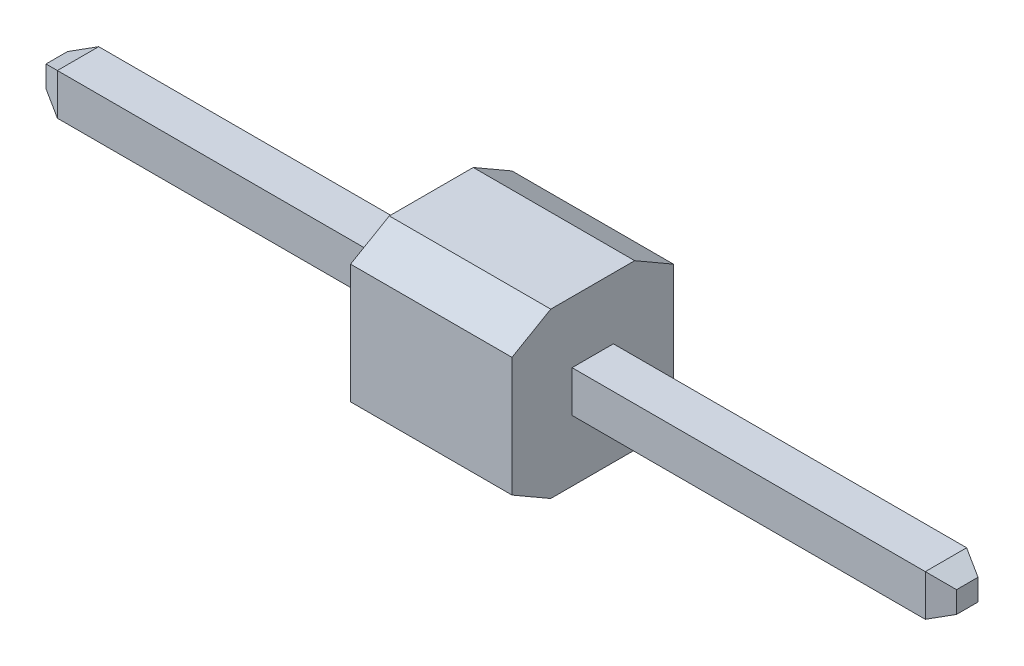
ISO-10303-21;
HEADER;
FILE_DESCRIPTION(('STEP AP214'),'2;1');
FILE_NAME('part.step','',(''),(''),'','','');
FILE_SCHEMA(('AUTOMOTIVE_DESIGN { 1 0 10303 214 1 1 1 1 }'));
ENDSEC;
DATA;
#1=APPLICATION_CONTEXT('core data for automotive mechanical design processes');
#2=APPLICATION_PROTOCOL_DEFINITION('international standard','automotive_design',2000,#1);
#3=PRODUCT_CONTEXT('',#1,'mechanical');
#4=PRODUCT('Part','Part','',(#3));
#5=PRODUCT_RELATED_PRODUCT_CATEGORY('part','',(#4));
#6=PRODUCT_DEFINITION_FORMATION('','',#4);
#7=PRODUCT_DEFINITION_CONTEXT('part definition',#1,'design');
#8=PRODUCT_DEFINITION('design','',#6,#7);
#9=PRODUCT_DEFINITION_SHAPE('','',#8);
#10=(LENGTH_UNIT() NAMED_UNIT(*) SI_UNIT(.MILLI.,.METRE.));
#11=(NAMED_UNIT(*) PLANE_ANGLE_UNIT() SI_UNIT($,.RADIAN.));
#12=(NAMED_UNIT(*) SI_UNIT($,.STERADIAN.) SOLID_ANGLE_UNIT());
#13=UNCERTAINTY_MEASURE_WITH_UNIT(LENGTH_MEASURE(1.E-05),#10,'distance_accuracy_value','');
#14=(GEOMETRIC_REPRESENTATION_CONTEXT(3) GLOBAL_UNCERTAINTY_ASSIGNED_CONTEXT((#13)) GLOBAL_UNIT_ASSIGNED_CONTEXT((#10,
#11,#12)) REPRESENTATION_CONTEXT('',''));
#15=CARTESIAN_POINT('',(0.,0.,0.));
#16=DIRECTION('',(0.,0.,1.));
#17=DIRECTION('',(1.,0.,0.));
#18=AXIS2_PLACEMENT_3D('',#15,#16,#17);
#19=CARTESIAN_POINT('',(5.42105037206763,-5.39712826291391,0.629998634255617));
#20=DIRECTION('',(1.,4.37113882867379E-08,-4.37113882867379E-08));
#21=DIRECTION('',(-4.37113882867379E-08,1.,0.));
#22=AXIS2_PLACEMENT_3D('',#19,#20,#21);
#23=PLANE('',#22);
#24=DIRECTION('',(1.59994777304464E-08,0.500000000000191,0.866025403784328));
#25=VECTOR('',#24,1.);
#26=CARTESIAN_POINT('',(5.42105024908172,-4.15353842442391,-0.940001365744382));
#27=LINE('',#26,#25);
#28=CARTESIAN_POINT('',(5.42105024908172,-4.15353842442391,-0.940001365744382));
#29=VERTEX_POINT('',#28);
#30=CARTESIAN_POINT('',(5.42105026016648,-3.80712826291392,-0.340001365744383));
#31=VERTEX_POINT('',#30);
#32=EDGE_CURVE('E11',#29,#31,#27,.T.);
#33=ORIENTED_EDGE('',*,*,#32,.T.);
#34=DIRECTION('',(4.37113886966664E-08,0.,0.999999999999999));
#35=VECTOR('',#34,1.);
#36=CARTESIAN_POINT('',(5.42105026016648,-3.80712826291392,-0.340001365744383));
#37=LINE('',#36,#35);
#38=CARTESIAN_POINT('',(5.42105031699128,-3.80712826291391,0.959998634255618));
#39=VERTEX_POINT('',#38);
#40=EDGE_CURVE('E304',#31,#39,#37,.T.);
#41=ORIENTED_EDGE('',*,*,#40,.T.);
#42=DIRECTION('',(5.97108668825762E-08,-0.500000000000186,0.866025403784329));
#43=VECTOR('',#42,1.);
#44=CARTESIAN_POINT('',(5.42105031699128,-3.80712826291391,0.959998634255618));
#45=LINE('',#44,#43);
#46=CARTESIAN_POINT('',(5.42105035836019,-4.15353842442391,1.55999863425562));
#47=VERTEX_POINT('',#46);
#48=EDGE_CURVE('E296',#39,#47,#45,.T.);
#49=ORIENTED_EDGE('',*,*,#48,.T.);
#50=DIRECTION('',(4.37113884815545E-08,-0.999999999999999,0.));
#51=VECTOR('',#50,1.);
#52=CARTESIAN_POINT('',(5.42105035836019,-4.15353842442391,1.55999863425562));
#53=LINE('',#52,#51);
#54=CARTESIAN_POINT('',(5.42105043910298,-6.00071810139391,1.55999863425562));
#55=VERTEX_POINT('',#54);
#56=EDGE_CURVE('E281',#47,#55,#53,.T.);
#57=ORIENTED_EDGE('',*,*,#56,.T.);
#58=DIRECTION('',(1.5999479012306E-08,0.500000000000191,0.866025403784328));
#59=VECTOR('',#58,1.);
#60=CARTESIAN_POINT('',(5.42105042801821,-6.34712826291391,0.959998634255618));
#61=LINE('',#60,#59);
#62=CARTESIAN_POINT('',(5.42105042801821,-6.34712826291391,0.959998634255618));
#63=VERTEX_POINT('',#62);
#64=EDGE_CURVE('E265',#63,#55,#61,.T.);
#65=ORIENTED_EDGE('',*,*,#64,.F.);
#66=DIRECTION('',(4.37113886966664E-08,0.,0.999999999999999));
#67=VECTOR('',#66,1.);
#68=CARTESIAN_POINT('',(5.42105037119341,-6.34712826291392,-0.340001365744383));
#69=LINE('',#68,#67);
#70=CARTESIAN_POINT('',(5.42105037119341,-6.34712826291392,-0.340001365744383));
#71=VERTEX_POINT('',#70);
#72=EDGE_CURVE('E248',#71,#63,#69,.T.);
#73=ORIENTED_EDGE('',*,*,#72,.F.);
#74=DIRECTION('',(5.97108656001698E-08,-0.50000000000019,0.866025403784327));
#75=VECTOR('',#74,1.);
#76=CARTESIAN_POINT('',(5.4210503298245,-6.00071810139391,-0.940001365744382));
#77=LINE('',#76,#75);
#78=CARTESIAN_POINT('',(5.4210503298245,-6.00071810139391,-0.940001365744382));
#79=VERTEX_POINT('',#78);
#80=EDGE_CURVE('E242',#79,#71,#77,.T.);
#81=ORIENTED_EDGE('',*,*,#80,.F.);
#82=DIRECTION('',(4.37113884815545E-08,-0.999999999999999,0.));
#83=VECTOR('',#82,1.);
#84=CARTESIAN_POINT('',(5.42105024908172,-4.15353842442391,-0.940001365744382));
#85=LINE('',#84,#83);
#86=EDGE_CURVE('E236',#29,#79,#85,.T.);
#87=ORIENTED_EDGE('',*,*,#86,.F.);
#88=EDGE_LOOP('',(#33,#41,#49,#57,#65,#73,#81,#87));
#89=FACE_BOUND('',#88,.T.);
#90=DIRECTION('',(-4.37113872875372E-08,0.,-0.999999999999999));
#91=VECTOR('',#90,1.);
#92=CARTESIAN_POINT('',(5.42105034409235,-4.75712826291391,0.629998634255617));
#93=LINE('',#92,#91);
#94=CARTESIAN_POINT('',(5.42105034409235,-4.75712826291391,0.629998634255617));
#95=VERTEX_POINT('',#94);
#96=CARTESIAN_POINT('',(5.42105031611706,-4.75712826291391,-0.0100013657443826));
#97=VERTEX_POINT('',#96);
#98=EDGE_CURVE('E302',#95,#97,#93,.T.);
#99=ORIENTED_EDGE('',*,*,#98,.T.);
#100=DIRECTION('',(-4.37113872875371E-08,0.999999999999999,0.));
#101=VECTOR('',#100,1.);
#102=CARTESIAN_POINT('',(5.42105034409235,-5.39712826291391,-0.0100013657443826));
#103=LINE('',#102,#101);
#104=CARTESIAN_POINT('',(5.42105034409235,-5.39712826291391,-0.0100013657443826));
#105=VERTEX_POINT('',#104);
#106=EDGE_CURVE('E293',#105,#97,#103,.T.);
#107=ORIENTED_EDGE('',*,*,#106,.F.);
#108=DIRECTION('',(-4.37113900630947E-08,0.,-0.999999999999999));
#109=VECTOR('',#108,1.);
#110=CARTESIAN_POINT('',(5.42105037206763,-5.39712826291391,0.629998634255617));
#111=LINE('',#110,#109);
#112=CARTESIAN_POINT('',(5.42105037206763,-5.39712826291391,0.629998634255617));
#113=VERTEX_POINT('',#112);
#114=EDGE_CURVE('E278',#113,#105,#111,.T.);
#115=ORIENTED_EDGE('',*,*,#114,.F.);
#116=DIRECTION('',(-4.37113900630947E-08,0.999999999999999,0.));
#117=VECTOR('',#116,1.);
#118=CARTESIAN_POINT('',(5.42105037206763,-5.39712826291391,0.629998634255617));
#119=LINE('',#118,#117);
#120=EDGE_CURVE('E263',#113,#95,#119,.T.);
#121=ORIENTED_EDGE('',*,*,#120,.T.);
#122=EDGE_LOOP('',(#99,#107,#115,#121));
#123=FACE_BOUND('',#122,.T.);
#124=ADVANCED_FACE('F17',(#89,#123),#23,.T.);
#125=CARTESIAN_POINT('',(2.92105037206763,-5.39712837219238,0.629998743534088));
#126=DIRECTION('',(1.,4.37113882867379E-08,-4.37113882867379E-08));
#127=DIRECTION('',(-4.37113882867379E-08,1.,0.));
#128=AXIS2_PLACEMENT_3D('',#125,#126,#127);
#129=PLANE('',#128);
#130=DIRECTION('',(1.59994783714339E-08,0.500000000000191,0.866025403784328));
#131=VECTOR('',#130,1.);
#132=CARTESIAN_POINT('',(2.92105024908172,-4.15353853370238,-0.940001256465912));
#133=LINE('',#132,#131);
#134=CARTESIAN_POINT('',(2.92105024908172,-4.15353853370238,-0.940001256465912));
#135=VERTEX_POINT('',#134);
#136=CARTESIAN_POINT('',(2.92105026016648,-3.80712837219239,-0.340001256465912));
#137=VERTEX_POINT('',#136);
#138=EDGE_CURVE('E24',#135,#137,#133,.T.);
#139=ORIENTED_EDGE('',*,*,#138,.F.);
#140=DIRECTION('',(4.37113882411397E-08,-0.999999999999999,0.));
#141=VECTOR('',#140,1.);
#142=CARTESIAN_POINT('',(2.92105024908172,-4.15353853370238,-0.940001256465912));
#143=LINE('',#142,#141);
#144=CARTESIAN_POINT('',(2.9210503298245,-6.00071821067239,-0.940001256465912));
#145=VERTEX_POINT('',#144);
#146=EDGE_CURVE('E300',#135,#145,#143,.T.);
#147=ORIENTED_EDGE('',*,*,#146,.T.);
#148=DIRECTION('',(5.97108668821449E-08,-0.50000000000019,0.866025403784327));
#149=VECTOR('',#148,1.);
#150=CARTESIAN_POINT('',(2.9210503298245,-6.00071821067239,-0.940001256465912));
#151=LINE('',#150,#149);
#152=CARTESIAN_POINT('',(2.92105037119341,-6.34712837219239,-0.340001256465912));
#153=VERTEX_POINT('',#152);
#154=EDGE_CURVE('E286',#145,#153,#151,.T.);
#155=ORIENTED_EDGE('',*,*,#154,.T.);
#156=DIRECTION('',(4.37113883550593E-08,0.,0.999999999999999));
#157=VECTOR('',#156,1.);
#158=CARTESIAN_POINT('',(2.92105037119341,-6.34712837219239,-0.340001256465912));
#159=LINE('',#158,#157);
#160=CARTESIAN_POINT('',(2.92105042801821,-6.34712837219238,0.959998743534088));
#161=VERTEX_POINT('',#160);
#162=EDGE_CURVE('E271',#153,#161,#159,.T.);
#163=ORIENTED_EDGE('',*,*,#162,.T.);
#164=DIRECTION('',(1.59994783713184E-08,0.500000000000191,0.866025403784328));
#165=VECTOR('',#164,1.);
#166=CARTESIAN_POINT('',(2.92105042801821,-6.34712837219238,0.959998743534088));
#167=LINE('',#166,#165);
#168=CARTESIAN_POINT('',(2.92105043910298,-6.00071821067238,1.55999874353409));
#169=VERTEX_POINT('',#168);
#170=EDGE_CURVE('E253',#161,#169,#167,.T.);
#171=ORIENTED_EDGE('',*,*,#170,.T.);
#172=DIRECTION('',(4.37113882411397E-08,-0.999999999999999,0.));
#173=VECTOR('',#172,1.);
#174=CARTESIAN_POINT('',(2.92105035836019,-4.15353853370238,1.55999874353409));
#175=LINE('',#174,#173);
#176=CARTESIAN_POINT('',(2.92105035836019,-4.15353853370238,1.55999874353409));
#177=VERTEX_POINT('',#176);
#178=EDGE_CURVE('E261',#177,#169,#175,.T.);
#179=ORIENTED_EDGE('',*,*,#178,.F.);
#180=DIRECTION('',(5.97108668825762E-08,-0.500000000000186,0.866025403784329));
#181=VECTOR('',#180,1.);
#182=CARTESIAN_POINT('',(2.92105031699128,-3.80712837219238,0.959998743534088));
#183=LINE('',#182,#181);
#184=CARTESIAN_POINT('',(2.92105031699128,-3.80712837219238,0.959998743534088));
#185=VERTEX_POINT('',#184);
#186=EDGE_CURVE('E276',#185,#177,#183,.T.);
#187=ORIENTED_EDGE('',*,*,#186,.F.);
#188=DIRECTION('',(4.37113883550593E-08,0.,0.999999999999999));
#189=VECTOR('',#188,1.);
#190=CARTESIAN_POINT('',(2.92105026016648,-3.80712837219239,-0.340001256465912));
#191=LINE('',#190,#189);
#192=EDGE_CURVE('E291',#137,#185,#191,.T.);
#193=ORIENTED_EDGE('',*,*,#192,.F.);
#194=EDGE_LOOP('',(#139,#147,#155,#163,#171,#179,#187,#193));
#195=FACE_BOUND('',#194,.T.);
#196=DIRECTION('',(-4.37113879814265E-08,0.999999999999999,0.));
#197=VECTOR('',#196,1.);
#198=CARTESIAN_POINT('',(2.92105034409235,-5.39712837219238,-0.0100012564659119));
#199=LINE('',#198,#197);
#200=CARTESIAN_POINT('',(2.92105034409235,-5.39712837219238,-0.0100012564659119));
#201=VERTEX_POINT('',#200);
#202=CARTESIAN_POINT('',(2.92105031611706,-4.75712837219238,-0.0100012564659119));
#203=VERTEX_POINT('',#202);
#204=EDGE_CURVE('E298',#201,#203,#199,.T.);
#205=ORIENTED_EDGE('',*,*,#204,.T.);
#206=DIRECTION('',(-4.37113879814266E-08,0.,-0.999999999999999));
#207=VECTOR('',#206,1.);
#208=CARTESIAN_POINT('',(2.92105034409235,-4.75712837219238,0.629998743534088));
#209=LINE('',#208,#207);
#210=CARTESIAN_POINT('',(2.92105034409235,-4.75712837219238,0.629998743534088));
#211=VERTEX_POINT('',#210);
#212=EDGE_CURVE('E283',#211,#203,#209,.T.);
#213=ORIENTED_EDGE('',*,*,#212,.F.);
#214=DIRECTION('',(-4.37113886753159E-08,0.999999999999999,0.));
#215=VECTOR('',#214,1.);
#216=CARTESIAN_POINT('',(2.92105037206763,-5.39712837219238,0.629998743534088));
#217=LINE('',#216,#215);
#218=CARTESIAN_POINT('',(2.92105037206763,-5.39712837219238,0.629998743534088));
#219=VERTEX_POINT('',#218);
#220=EDGE_CURVE('E268',#219,#211,#217,.T.);
#221=ORIENTED_EDGE('',*,*,#220,.F.);
#222=DIRECTION('',(-4.37113886753159E-08,0.,-0.999999999999999));
#223=VECTOR('',#222,1.);
#224=CARTESIAN_POINT('',(2.92105037206763,-5.39712837219238,0.629998743534088));
#225=LINE('',#224,#223);
#226=EDGE_CURVE('E251',#219,#201,#225,.T.);
#227=ORIENTED_EDGE('',*,*,#226,.T.);
#228=EDGE_LOOP('',(#205,#213,#221,#227));
#229=FACE_BOUND('',#228,.T.);
#230=ADVANCED_FACE('F314',(#195,#229),#129,.F.);
#231=CARTESIAN_POINT('',(5.42105024908172,-4.15353842442391,-0.940001365744382));
#232=DIRECTION('',(5.97108668343731E-08,-0.866025403784328,0.50000000000019));
#233=DIRECTION('',(-1.59994785476185E-08,-0.500000000000192,-0.866025403784329));
#234=AXIS2_PLACEMENT_3D('',#231,#232,#233);
#235=PLANE('',#234);
#236=ORIENTED_EDGE('',*,*,#138,.T.);
#237=DIRECTION('',(-0.999999999999998,-4.37113868656524E-08,4.37113883755557E-08));
#238=VECTOR('',#237,1.);
#239=CARTESIAN_POINT('',(5.42105026016648,-3.80712826291392,-0.340001365744383));
#240=LINE('',#239,#238);
#241=EDGE_CURVE('E288',#31,#137,#240,.T.);
#242=ORIENTED_EDGE('',*,*,#241,.F.);
#243=ORIENTED_EDGE('',*,*,#32,.F.);
#244=DIRECTION('',(-0.999999999999998,-4.37113868656524E-08,4.37113881091022E-08));
#245=VECTOR('',#244,1.);
#246=CARTESIAN_POINT('',(5.42105024908172,-4.15353842442391,-0.940001365744382));
#247=LINE('',#246,#245);
#248=EDGE_CURVE('E256',#29,#135,#247,.T.);
#249=ORIENTED_EDGE('',*,*,#248,.T.);
#250=EDGE_LOOP('',(#236,#242,#243,#249));
#251=FACE_BOUND('',#250,.T.);
#252=ADVANCED_FACE('F306',(#251),#235,.F.);
#253=CARTESIAN_POINT('',(5.42105026016648,-3.80712826291392,-0.340001365744383));
#254=DIRECTION('',(4.37113882867379E-08,-1.,0.));
#255=DIRECTION('',(1.,4.37113882867379E-08,-4.37113882867379E-08));
#256=AXIS2_PLACEMENT_3D('',#253,#254,#255);
#257=PLANE('',#256);
#258=ORIENTED_EDGE('',*,*,#192,.T.);
#259=DIRECTION('',(-0.999999999999998,-4.37113868656524E-08,4.37113882867378E-08));
#260=VECTOR('',#259,1.);
#261=CARTESIAN_POINT('',(5.42105031699128,-3.80712826291391,0.959998634255618));
#262=LINE('',#261,#260);
#263=EDGE_CURVE('E273',#39,#185,#262,.T.);
#264=ORIENTED_EDGE('',*,*,#263,.F.);
#265=ORIENTED_EDGE('',*,*,#40,.F.);
#266=ORIENTED_EDGE('',*,*,#241,.T.);
#267=EDGE_LOOP('',(#258,#264,#265,#266));
#268=FACE_BOUND('',#267,.T.);
#269=ADVANCED_FACE('F311',(#268),#257,.F.);
#270=CARTESIAN_POINT('',(5.42105031699128,-3.80712826291391,0.959998634255618));
#271=DIRECTION('',(1.59994785476185E-08,-0.86602540378433,-0.50000000000019));
#272=DIRECTION('',(-5.97108668343731E-08,0.500000000000188,-0.866025403784329));
#273=AXIS2_PLACEMENT_3D('',#270,#271,#272);
#274=PLANE('',#273);
#275=ORIENTED_EDGE('',*,*,#186,.T.);
#276=DIRECTION('',(-0.999999999999998,-4.37113868656524E-08,4.37113882867378E-08));
#277=VECTOR('',#276,1.);
#278=CARTESIAN_POINT('',(5.42105035836019,-4.15353842442391,1.55999863425562));
#279=LINE('',#278,#277);
#280=EDGE_CURVE('E258',#47,#177,#279,.T.);
#281=ORIENTED_EDGE('',*,*,#280,.F.);
#282=ORIENTED_EDGE('',*,*,#48,.F.);
#283=ORIENTED_EDGE('',*,*,#263,.T.);
#284=EDGE_LOOP('',(#275,#281,#282,#283));
#285=FACE_BOUND('',#284,.T.);
#286=ADVANCED_FACE('F319',(#285),#274,.F.);
#287=CARTESIAN_POINT('',(5.42105035836019,-4.15353842442391,1.55999863425562));
#288=DIRECTION('',(-4.37113882867379E-08,0.,-1.));
#289=DIRECTION('',(-1.,-4.37113882867379E-08,4.37113882867379E-08));
#290=AXIS2_PLACEMENT_3D('',#287,#288,#289);
#291=PLANE('',#290);
#292=ORIENTED_EDGE('',*,*,#178,.T.);
#293=DIRECTION('',(-0.999999999999998,-4.37113868656524E-08,4.37113882867378E-08));
#294=VECTOR('',#293,1.);
#295=CARTESIAN_POINT('',(5.42105043910298,-6.00071810139391,1.55999863425562));
#296=LINE('',#295,#294);
#297=EDGE_CURVE('E245',#55,#169,#296,.T.);
#298=ORIENTED_EDGE('',*,*,#297,.F.);
#299=ORIENTED_EDGE('',*,*,#56,.F.);
#300=ORIENTED_EDGE('',*,*,#280,.T.);
#301=EDGE_LOOP('',(#292,#298,#299,#300));
#302=FACE_BOUND('',#301,.T.);
#303=ADVANCED_FACE('F326',(#302),#291,.F.);
#304=CARTESIAN_POINT('',(5.42105042801821,-6.34712826291391,0.959998634255618));
#305=DIRECTION('',(5.97108668343731E-08,-0.866025403784328,0.50000000000019));
#306=DIRECTION('',(-1.59994785476185E-08,-0.500000000000192,-0.866025403784329));
#307=AXIS2_PLACEMENT_3D('',#304,#305,#306);
#308=PLANE('',#307);
#309=ORIENTED_EDGE('',*,*,#170,.F.);
#310=DIRECTION('',(-0.999999999999998,-4.37113897078233E-08,4.37113882867378E-08));
#311=VECTOR('',#310,1.);
#312=CARTESIAN_POINT('',(5.42105042801821,-6.34712826291391,0.959998634255618));
#313=LINE('',#312,#311);
#314=EDGE_CURVE('E239',#63,#161,#313,.T.);
#315=ORIENTED_EDGE('',*,*,#314,.F.);
#316=ORIENTED_EDGE('',*,*,#64,.T.);
#317=ORIENTED_EDGE('',*,*,#297,.T.);
#318=EDGE_LOOP('',(#309,#315,#316,#317));
#319=FACE_BOUND('',#318,.T.);
#320=ADVANCED_FACE('F329',(#319),#308,.T.);
#321=CARTESIAN_POINT('',(5.42105037119341,-6.34712826291392,-0.340001365744383));
#322=DIRECTION('',(4.37113882867379E-08,-1.,0.));
#323=DIRECTION('',(1.,4.37113882867379E-08,-4.37113882867379E-08));
#324=AXIS2_PLACEMENT_3D('',#321,#322,#323);
#325=PLANE('',#324);
#326=ORIENTED_EDGE('',*,*,#162,.F.);
#327=DIRECTION('',(-0.999999999999998,-4.37113897078233E-08,4.37113883755557E-08));
#328=VECTOR('',#327,1.);
#329=CARTESIAN_POINT('',(5.42105037119341,-6.34712826291392,-0.340001365744383));
#330=LINE('',#329,#328);
#331=EDGE_CURVE('E233',#71,#153,#330,.T.);
#332=ORIENTED_EDGE('',*,*,#331,.F.);
#333=ORIENTED_EDGE('',*,*,#72,.T.);
#334=ORIENTED_EDGE('',*,*,#314,.T.);
#335=EDGE_LOOP('',(#326,#332,#333,#334));
#336=FACE_BOUND('',#335,.T.);
#337=ADVANCED_FACE('F333',(#336),#325,.T.);
#338=CARTESIAN_POINT('',(5.4210503298245,-6.00071810139391,-0.940001365744382));
#339=DIRECTION('',(1.59994785476185E-08,-0.86602540378433,-0.50000000000019));
#340=DIRECTION('',(-5.97108668343731E-08,0.500000000000188,-0.866025403784329));
#341=AXIS2_PLACEMENT_3D('',#338,#339,#340);
#342=PLANE('',#341);
#343=ORIENTED_EDGE('',*,*,#154,.F.);
#344=DIRECTION('',(-0.999999999999998,-4.37113868656524E-08,4.37113881091021E-08));
#345=VECTOR('',#344,1.);
#346=CARTESIAN_POINT('',(5.4210503298245,-6.00071810139391,-0.940001365744382));
#347=LINE('',#346,#345);
#348=EDGE_CURVE('E230',#79,#145,#347,.T.);
#349=ORIENTED_EDGE('',*,*,#348,.F.);
#350=ORIENTED_EDGE('',*,*,#80,.T.);
#351=ORIENTED_EDGE('',*,*,#331,.T.);
#352=EDGE_LOOP('',(#343,#349,#350,#351));
#353=FACE_BOUND('',#352,.T.);
#354=ADVANCED_FACE('F337',(#353),#342,.T.);
#355=CARTESIAN_POINT('',(5.42105024908172,-4.15353842442391,-0.940001365744382));
#356=DIRECTION('',(-4.37113882867379E-08,0.,-1.));
#357=DIRECTION('',(-4.37113882867379E-08,1.,0.));
#358=AXIS2_PLACEMENT_3D('',#355,#356,#357);
#359=PLANE('',#358);
#360=ORIENTED_EDGE('',*,*,#146,.F.);
#361=ORIENTED_EDGE('',*,*,#248,.F.);
#362=ORIENTED_EDGE('',*,*,#86,.T.);
#363=ORIENTED_EDGE('',*,*,#348,.T.);
#364=EDGE_LOOP('',(#360,#361,#362,#363));
#365=FACE_BOUND('',#364,.T.);
#366=ADVANCED_FACE('F339',(#365),#359,.T.);
#367=CARTESIAN_POINT('',(-2.87894962793237,-5.39712862571844,0.62999899706014));
#368=DIRECTION('',(-1.,-4.37113882867379E-08,4.37113882867379E-08));
#369=DIRECTION('',(4.37113882867379E-08,-1.,0.));
#370=AXIS2_PLACEMENT_3D('',#367,#368,#369);
#371=PLANE('',#370);
#372=DIRECTION('',(4.37113874024238E-08,-0.999999999999999,0.));
#373=VECTOR('',#372,1.);
#374=CARTESIAN_POINT('',(-2.87894967043019,-4.91101015290844,0.14388052425114));
#375=LINE('',#374,#373);
#376=CARTESIAN_POINT('',(-2.87894967043019,-4.91101015290844,0.14388052425114));
#377=VERTEX_POINT('',#376);
#378=CARTESIAN_POINT('',(-2.87894965590765,-5.24324709851844,0.14388052425114));
#379=VERTEX_POINT('',#378);
#380=EDGE_CURVE('E228',#377,#379,#375,.T.);
#381=ORIENTED_EDGE('',*,*,#380,.T.);
#382=DIRECTION('',(4.37113874013716E-08,0.,0.999999999999999));
#383=VECTOR('',#382,1.);
#384=CARTESIAN_POINT('',(-2.87894965590766,-5.24324709851844,0.14388052425114));
#385=LINE('',#384,#383);
#386=CARTESIAN_POINT('',(-2.87894964138512,-5.24324709851844,0.47611746986914));
#387=VERTEX_POINT('',#386);
#388=EDGE_CURVE('E223',#379,#387,#385,.T.);
#389=ORIENTED_EDGE('',*,*,#388,.T.);
#390=DIRECTION('',(-4.37113900757521E-08,0.999999999999999,0.));
#391=VECTOR('',#390,1.);
#392=CARTESIAN_POINT('',(-2.87894964138512,-5.24324709851844,0.47611746986914));
#393=LINE('',#392,#391);
#394=CARTESIAN_POINT('',(-2.87894965590765,-4.91101015290844,0.47611746986914));
#395=VERTEX_POINT('',#394);
#396=EDGE_CURVE('E215',#387,#395,#393,.T.);
#397=ORIENTED_EDGE('',*,*,#396,.T.);
#398=DIRECTION('',(-4.37113847280434E-08,0.,-0.999999999999999));
#399=VECTOR('',#398,1.);
#400=CARTESIAN_POINT('',(-2.87894965590766,-4.91101015290843,0.47611746986914));
#401=LINE('',#400,#399);
#402=EDGE_CURVE('E207',#395,#377,#401,.T.);
#403=ORIENTED_EDGE('',*,*,#402,.T.);
#404=EDGE_LOOP('',(#381,#389,#397,#403));
#405=FACE_BOUND('',#404,.T.);
#406=ADVANCED_FACE('F341',(#405),#371,.T.);
#407=CARTESIAN_POINT('',(-2.87894962793237,-5.39712862571844,0.62999899706014));
#408=DIRECTION('',(4.37113882867379E-08,-1.,0.));
#409=DIRECTION('',(-4.37113882867379E-08,0.,-1.));
#410=AXIS2_PLACEMENT_3D('',#407,#408,#409);
#411=PLANE('',#410);
#412=DIRECTION('',(0.999999999999998,4.37113881958092E-08,-4.37113882769955E-08));
#413=VECTOR('',#412,1.);
#414=CARTESIAN_POINT('',(-2.54894962793237,-5.39712861129368,0.629998982635382));
#415=LINE('',#414,#413);
#416=CARTESIAN_POINT('',(-2.54894962793237,-5.39712861129368,0.629998982635382));
#417=VERTEX_POINT('',#416);
#418=EDGE_CURVE('E225',#417,#219,#415,.T.);
#419=ORIENTED_EDGE('',*,*,#418,.F.);
#420=DIRECTION('',(-4.37113872875372E-08,0.,-0.999999999999999));
#421=VECTOR('',#420,1.);
#422=CARTESIAN_POINT('',(-2.54894962793237,-5.39712861129368,0.629998982635382));
#423=LINE('',#422,#421);
#424=CARTESIAN_POINT('',(-2.54894965590765,-5.39712861129368,-0.010001017364618));
#425=VERTEX_POINT('',#424);
#426=EDGE_CURVE('E217',#417,#425,#423,.T.);
#427=ORIENTED_EDGE('',*,*,#426,.T.);
#428=DIRECTION('',(0.999999999999998,4.37113881958092E-08,-4.37113882161058E-08));
#429=VECTOR('',#428,1.);
#430=CARTESIAN_POINT('',(-2.54894965590765,-5.39712861129368,-0.010001017364618));
#431=LINE('',#430,#429);
#432=EDGE_CURVE('E220',#425,#201,#431,.T.);
#433=ORIENTED_EDGE('',*,*,#432,.T.);
#434=ORIENTED_EDGE('',*,*,#226,.F.);
#435=EDGE_LOOP('',(#419,#427,#433,#434));
#436=FACE_BOUND('',#435,.T.);
#437=ADVANCED_FACE('F348',(#436),#411,.T.);
#438=CARTESIAN_POINT('',(-2.87894965590765,-5.39712862571844,-0.0100010029398598));
#439=DIRECTION('',(-4.37113882867379E-08,0.,-1.));
#440=DIRECTION('',(-1.,-4.37113882867379E-08,4.37113882867379E-08));
#441=AXIS2_PLACEMENT_3D('',#438,#439,#440);
#442=PLANE('',#441);
#443=ORIENTED_EDGE('',*,*,#432,.F.);
#444=DIRECTION('',(-4.37113886753159E-08,0.999999999999999,0.));
#445=VECTOR('',#444,1.);
#446=CARTESIAN_POINT('',(-2.54894965590765,-5.39712861129368,-0.010001017364618));
#447=LINE('',#446,#445);
#448=CARTESIAN_POINT('',(-2.54894968388294,-4.75712861129368,-0.010001017364618));
#449=VERTEX_POINT('',#448);
#450=EDGE_CURVE('E209',#425,#449,#447,.T.);
#451=ORIENTED_EDGE('',*,*,#450,.T.);
#452=DIRECTION('',(0.999999999999998,4.37113881958092E-08,-4.37113882161057E-08));
#453=VECTOR('',#452,1.);
#454=CARTESIAN_POINT('',(-2.54894968388294,-4.75712861129368,-0.010001017364618));
#455=LINE('',#454,#453);
#456=EDGE_CURVE('E212',#449,#203,#455,.T.);
#457=ORIENTED_EDGE('',*,*,#456,.T.);
#458=ORIENTED_EDGE('',*,*,#204,.F.);
#459=EDGE_LOOP('',(#443,#451,#457,#458));
#460=FACE_BOUND('',#459,.T.);
#461=ADVANCED_FACE('F424',(#460),#442,.T.);
#462=CARTESIAN_POINT('',(-2.87894965590765,-4.75712862571844,0.62999899706014));
#463=DIRECTION('',(4.37113882867379E-08,-1.,0.));
#464=DIRECTION('',(-4.37113882867379E-08,0.,-1.));
#465=AXIS2_PLACEMENT_3D('',#462,#463,#464);
#466=PLANE('',#465);
#467=ORIENTED_EDGE('',*,*,#456,.F.);
#468=DIRECTION('',(4.37113900630947E-08,0.,0.999999999999999));
#469=VECTOR('',#468,1.);
#470=CARTESIAN_POINT('',(-2.54894968388294,-4.75712861129368,-0.010001017364618));
#471=LINE('',#470,#469);
#472=CARTESIAN_POINT('',(-2.54894965590765,-4.75712861129368,0.629998982635382));
#473=VERTEX_POINT('',#472);
#474=EDGE_CURVE('E201',#449,#473,#471,.T.);
#475=ORIENTED_EDGE('',*,*,#474,.T.);
#476=DIRECTION('',(0.999999999999998,4.37113881958092E-08,-4.37113882769955E-08));
#477=VECTOR('',#476,1.);
#478=CARTESIAN_POINT('',(-2.54894965590765,-4.75712861129368,0.629998982635382));
#479=LINE('',#478,#477);
#480=EDGE_CURVE('E204',#473,#211,#479,.T.);
#481=ORIENTED_EDGE('',*,*,#480,.T.);
#482=ORIENTED_EDGE('',*,*,#212,.T.);
#483=EDGE_LOOP('',(#467,#475,#481,#482));
#484=FACE_BOUND('',#483,.T.);
#485=ADVANCED_FACE('F421',(#484),#466,.F.);
#486=CARTESIAN_POINT('',(-2.87894962793237,-5.39712862571844,0.62999899706014));
#487=DIRECTION('',(-4.37113882867379E-08,0.,-1.));
#488=DIRECTION('',(-1.,-4.37113882867379E-08,4.37113882867379E-08));
#489=AXIS2_PLACEMENT_3D('',#486,#487,#488);
#490=PLANE('',#489);
#491=ORIENTED_EDGE('',*,*,#480,.F.);
#492=DIRECTION('',(4.37113858997583E-08,-0.999999999999999,0.));
#493=VECTOR('',#492,1.);
#494=CARTESIAN_POINT('',(-2.54894965590765,-4.75712861129368,0.629998982635382));
#495=LINE('',#494,#493);
#496=EDGE_CURVE('E196',#473,#417,#495,.T.);
#497=ORIENTED_EDGE('',*,*,#496,.T.);
#498=ORIENTED_EDGE('',*,*,#418,.T.);
#499=ORIENTED_EDGE('',*,*,#220,.T.);
#500=EDGE_LOOP('',(#491,#497,#498,#499));
#501=FACE_BOUND('',#500,.T.);
#502=ADVANCED_FACE('F376',(#501),#490,.F.);
#503=CARTESIAN_POINT('',(-2.87894962793237,-5.39712862571844,0.62999899706014));
#504=DIRECTION('',(-4.37113882867379E-08,0.,-1.));
#505=DIRECTION('',(-1.,-4.37113882867379E-08,4.37113882867379E-08));
#506=AXIS2_PLACEMENT_3D('',#503,#504,#505);
#507=PLANE('',#506);
#508=DIRECTION('',(0.999999999999998,4.37113881958092E-08,-4.37113882769955E-08));
#509=VECTOR('',#508,1.);
#510=CARTESIAN_POINT('',(5.42105037206763,-5.39712826291391,0.629998634255617));
#511=LINE('',#510,#509);
#512=CARTESIAN_POINT('',(10.8910503720676,-5.39712802381262,0.629998395154324));
#513=VERTEX_POINT('',#512);
#514=EDGE_CURVE('E199',#113,#513,#511,.T.);
#515=ORIENTED_EDGE('',*,*,#514,.T.);
#516=DIRECTION('',(-4.37113872875371E-08,0.999999999999999,0.));
#517=VECTOR('',#516,1.);
#518=CARTESIAN_POINT('',(10.8910503720676,-5.39712802381262,0.629998395154324));
#519=LINE('',#518,#517);
#520=CARTESIAN_POINT('',(10.8910503440923,-4.75712802381262,0.629998395154324));
#521=VERTEX_POINT('',#520);
#522=EDGE_CURVE('E191',#513,#521,#519,.T.);
#523=ORIENTED_EDGE('',*,*,#522,.T.);
#524=DIRECTION('',(0.999999999999998,4.37113933917341E-08,-4.37113882769955E-08));
#525=VECTOR('',#524,1.);
#526=CARTESIAN_POINT('',(5.42105034409235,-4.75712826291393,0.629998634255617));
#527=LINE('',#526,#525);
#528=EDGE_CURVE('E194',#95,#521,#527,.T.);
#529=ORIENTED_EDGE('',*,*,#528,.F.);
#530=ORIENTED_EDGE('',*,*,#120,.F.);
#531=EDGE_LOOP('',(#515,#523,#529,#530));
#532=FACE_BOUND('',#531,.T.);
#533=ADVANCED_FACE('F367',(#532),#507,.F.);
#534=CARTESIAN_POINT('',(-2.87894965590765,-4.75712862571844,0.62999899706014));
#535=DIRECTION('',(4.37113882867379E-08,-1.,0.));
#536=DIRECTION('',(-4.37113882867379E-08,0.,-1.));
#537=AXIS2_PLACEMENT_3D('',#534,#535,#536);
#538=PLANE('',#537);
#539=ORIENTED_EDGE('',*,*,#528,.T.);
#540=DIRECTION('',(-4.37113900630947E-08,0.,-0.999999999999999));
#541=VECTOR('',#540,1.);
#542=CARTESIAN_POINT('',(10.8910503440923,-4.75712802381262,0.629998395154324));
#543=LINE('',#542,#541);
#544=CARTESIAN_POINT('',(10.8910503161171,-4.75712802381262,-0.0100016048456765));
#545=VERTEX_POINT('',#544);
#546=EDGE_CURVE('E186',#521,#545,#543,.T.);
#547=ORIENTED_EDGE('',*,*,#546,.T.);
#548=DIRECTION('',(0.999999999999998,4.37113933917341E-08,-4.37113881146228E-08));
#549=VECTOR('',#548,1.);
#550=CARTESIAN_POINT('',(5.42105031611706,-4.75712826291393,-0.0100013657443823));
#551=LINE('',#550,#549);
#552=EDGE_CURVE('E189',#97,#545,#551,.T.);
#553=ORIENTED_EDGE('',*,*,#552,.F.);
#554=ORIENTED_EDGE('',*,*,#98,.F.);
#555=EDGE_LOOP('',(#539,#547,#553,#554));
#556=FACE_BOUND('',#555,.T.);
#557=ADVANCED_FACE('F364',(#556),#538,.F.);
#558=CARTESIAN_POINT('',(-2.87894965590765,-5.39712862571844,-0.0100010029398598));
#559=DIRECTION('',(-4.37113882867379E-08,0.,-1.));
#560=DIRECTION('',(-1.,-4.37113882867379E-08,4.37113882867379E-08));
#561=AXIS2_PLACEMENT_3D('',#558,#559,#560);
#562=PLANE('',#561);
#563=ORIENTED_EDGE('',*,*,#552,.T.);
#564=DIRECTION('',(4.37113900630947E-08,-0.999999999999999,0.));
#565=VECTOR('',#564,1.);
#566=CARTESIAN_POINT('',(10.8910503161171,-4.75712802381262,-0.0100016048456764));
#567=LINE('',#566,#565);
#568=CARTESIAN_POINT('',(10.8910503440923,-5.39712802381262,-0.0100016048456765));
#569=VERTEX_POINT('',#568);
#570=EDGE_CURVE('E176',#545,#569,#567,.T.);
#571=ORIENTED_EDGE('',*,*,#570,.T.);
#572=DIRECTION('',(0.999999999999998,4.37113881958092E-08,-4.37113881146228E-08));
#573=VECTOR('',#572,1.);
#574=CARTESIAN_POINT('',(5.42105034409235,-5.39712826291391,-0.0100013657443823));
#575=LINE('',#574,#573);
#576=EDGE_CURVE('E179',#105,#569,#575,.T.);
#577=ORIENTED_EDGE('',*,*,#576,.F.);
#578=ORIENTED_EDGE('',*,*,#106,.T.);
#579=EDGE_LOOP('',(#563,#571,#577,#578));
#580=FACE_BOUND('',#579,.T.);
#581=ADVANCED_FACE('F366',(#580),#562,.T.);
#582=CARTESIAN_POINT('',(-2.87894962793237,-5.39712862571844,0.62999899706014));
#583=DIRECTION('',(4.37113882867379E-08,-1.,0.));
#584=DIRECTION('',(-4.37113882867379E-08,0.,-1.));
#585=AXIS2_PLACEMENT_3D('',#582,#583,#584);
#586=PLANE('',#585);
#587=ORIENTED_EDGE('',*,*,#576,.T.);
#588=DIRECTION('',(4.37113872875372E-08,0.,0.999999999999999));
#589=VECTOR('',#588,1.);
#590=CARTESIAN_POINT('',(10.8910503440923,-5.39712802381262,-0.0100016048456765));
#591=LINE('',#590,#589);
#592=EDGE_CURVE('E167',#569,#513,#591,.T.);
#593=ORIENTED_EDGE('',*,*,#592,.T.);
#594=ORIENTED_EDGE('',*,*,#514,.F.);
#595=ORIENTED_EDGE('',*,*,#114,.T.);
#596=EDGE_LOOP('',(#587,#593,#594,#595));
#597=FACE_BOUND('',#596,.T.);
#598=ADVANCED_FACE('F373',(#597),#586,.T.);
#599=CARTESIAN_POINT('',(11.2210503720676,-5.39712800938786,0.629998380729565));
#600=DIRECTION('',(-1.,-4.37113882867379E-08,4.37113882867379E-08));
#601=DIRECTION('',(4.37113882867379E-08,-1.,0.));
#602=AXIS2_PLACEMENT_3D('',#599,#600,#601);
#603=PLANE('',#602);
#604=DIRECTION('',(-4.37113874024238E-08,0.999999999999999,0.));
#605=VECTOR('',#604,1.);
#606=CARTESIAN_POINT('',(11.2210503440923,-5.24324648218786,0.143879907920565));
#607=LINE('',#606,#605);
#608=CARTESIAN_POINT('',(11.2210503440923,-5.24324648218786,0.143879907920565));
#609=VERTEX_POINT('',#608);
#610=CARTESIAN_POINT('',(11.2210503295698,-4.91100953657786,0.143879907920565));
#611=VERTEX_POINT('',#610);
#612=EDGE_CURVE('E153',#609,#611,#607,.T.);
#613=ORIENTED_EDGE('',*,*,#612,.T.);
#614=DIRECTION('',(4.37113874013716E-08,0.,0.999999999999999));
#615=VECTOR('',#614,1.);
#616=CARTESIAN_POINT('',(11.2210503295698,-4.91100953657786,0.143879907920565));
#617=LINE('',#616,#615);
#618=CARTESIAN_POINT('',(11.2210503440923,-4.91100953657786,0.476116853538565));
#619=VERTEX_POINT('',#618);
#620=EDGE_CURVE('E395',#611,#619,#617,.T.);
#621=ORIENTED_EDGE('',*,*,#620,.T.);
#622=DIRECTION('',(4.37113927490803E-08,-0.999999999999999,0.));
#623=VECTOR('',#622,1.);
#624=CARTESIAN_POINT('',(11.2210503440923,-4.91100953657786,0.476116853538565));
#625=LINE('',#624,#623);
#626=CARTESIAN_POINT('',(11.2210503586149,-5.24324648218786,0.476116853538565));
#627=VERTEX_POINT('',#626);
#628=EDGE_CURVE('E156',#619,#627,#625,.T.);
#629=ORIENTED_EDGE('',*,*,#628,.T.);
#630=DIRECTION('',(-4.37113980946847E-08,0.,-0.999999999999999));
#631=VECTOR('',#630,1.);
#632=CARTESIAN_POINT('',(11.2210503586149,-5.24324648218786,0.476116853538565));
#633=LINE('',#632,#631);
#634=EDGE_CURVE('E149',#627,#609,#633,.T.);
#635=ORIENTED_EDGE('',*,*,#634,.T.);
#636=EDGE_LOOP('',(#613,#621,#629,#635));
#637=FACE_BOUND('',#636,.T.);
#638=ADVANCED_FACE('F151',(#637),#603,.F.);
#639=CARTESIAN_POINT('',(-2.87894964918128,-4.91101015290844,0.62999899706014));
#640=DIRECTION('',(-0.422618301356784,0.906307768563367,1.84732310895534E-08));
#641=DIRECTION('',(4.37113882867379E-08,0.,1.));
#642=AXIS2_PLACEMENT_3D('',#639,#640,#641);
#643=PLANE('',#642);
#644=DIRECTION('',(0.834817095446925,0.389281657126021,-0.389281657126018));
#645=VECTOR('',#644,1.);
#646=CARTESIAN_POINT('',(-2.87894967043021,-4.91101015290792,0.143880524251623));
#647=LINE('',#646,#645);
#648=EDGE_CURVE('E181',#377,#449,#647,.T.);
#649=ORIENTED_EDGE('',*,*,#648,.F.);
#650=ORIENTED_EDGE('',*,*,#402,.F.);
#651=DIRECTION('',(-0.834817129479003,-0.389281657126029,-0.389281584143985));
#652=VECTOR('',#651,1.);
#653=CARTESIAN_POINT('',(-2.54894965590808,-4.75712861129221,0.629998982634844));
#654=LINE('',#653,#652);
#655=EDGE_CURVE('E404',#473,#395,#654,.T.);
#656=ORIENTED_EDGE('',*,*,#655,.F.);
#657=ORIENTED_EDGE('',*,*,#474,.F.);
#658=EDGE_LOOP('',(#649,#650,#656,#657));
#659=FACE_BOUND('',#658,.T.);
#660=ADVANCED_FACE('F418',(#659),#643,.T.);
#661=CARTESIAN_POINT('',(-2.87894963465874,-5.39712862571844,0.47611746986914));
#662=DIRECTION('',(-0.422618222124841,-1.84732292043498E-08,0.906307805509828));
#663=DIRECTION('',(4.37113882867379E-08,-1.,0.));
#664=AXIS2_PLACEMENT_3D('',#661,#662,#663);
#665=PLANE('',#664);
#666=ORIENTED_EDGE('',*,*,#655,.T.);
#667=ORIENTED_EDGE('',*,*,#396,.F.);
#668=DIRECTION('',(-0.83481716351109,0.389281584143977,-0.389281584143989));
#669=VECTOR('',#668,1.);
#670=CARTESIAN_POINT('',(-2.54894962793122,-5.39712861129095,0.629998982635654));
#671=LINE('',#670,#669);
#672=EDGE_CURVE('E160',#417,#387,#671,.T.);
#673=ORIENTED_EDGE('',*,*,#672,.F.);
#674=ORIENTED_EDGE('',*,*,#496,.F.);
#675=EDGE_LOOP('',(#666,#667,#673,#674));
#676=FACE_BOUND('',#675,.T.);
#677=ADVANCED_FACE('F434',(#676),#665,.T.);
#678=CARTESIAN_POINT('',(-2.54894965590765,-5.39712861129368,-0.010001017364618));
#679=DIRECTION('',(0.422618301356784,1.8473232667688E-08,0.906307768563367));
#680=DIRECTION('',(-4.37113882867379E-08,1.,0.));
#681=AXIS2_PLACEMENT_3D('',#678,#679,#680);
#682=PLANE('',#681);
#683=ORIENTED_EDGE('',*,*,#648,.T.);
#684=ORIENTED_EDGE('',*,*,#450,.F.);
#685=DIRECTION('',(0.834817129479008,-0.389281584143985,-0.389281657126018));
#686=VECTOR('',#685,1.);
#687=CARTESIAN_POINT('',(-2.87894965591049,-5.24324709852598,0.1438805242526));
#688=LINE('',#687,#686);
#689=EDGE_CURVE('E170',#379,#425,#688,.T.);
#690=ORIENTED_EDGE('',*,*,#689,.F.);
#691=ORIENTED_EDGE('',*,*,#380,.F.);
#692=EDGE_LOOP('',(#683,#684,#690,#691));
#693=FACE_BOUND('',#692,.T.);
#694=ADVANCED_FACE('F413',(#693),#682,.F.);
#695=CARTESIAN_POINT('',(-2.54894962793237,-5.39712861129368,0.629998982635382));
#696=DIRECTION('',(0.422618222124841,0.906307805509828,-1.84732308250282E-08));
#697=DIRECTION('',(-4.37113882867379E-08,0.,-1.));
#698=AXIS2_PLACEMENT_3D('',#695,#696,#697);
#699=PLANE('',#698);
#700=ORIENTED_EDGE('',*,*,#672,.T.);
#701=ORIENTED_EDGE('',*,*,#388,.F.);
#702=ORIENTED_EDGE('',*,*,#689,.T.);
#703=ORIENTED_EDGE('',*,*,#426,.F.);
#704=EDGE_LOOP('',(#700,#701,#702,#703));
#705=FACE_BOUND('',#704,.T.);
#706=ADVANCED_FACE('F429',(#705),#699,.F.);
#707=CARTESIAN_POINT('',(11.2210503653413,-5.24324648218786,0.629998380729565));
#708=DIRECTION('',(0.422618301356784,-0.906307768563367,-1.84732310470096E-08));
#709=DIRECTION('',(4.37113882867379E-08,0.,1.));
#710=AXIS2_PLACEMENT_3D('',#707,#708,#709);
#711=PLANE('',#710);
#712=DIRECTION('',(-0.834817129479005,-0.389281657126024,-0.389281584143985));
#713=VECTOR('',#712,1.);
#714=CARTESIAN_POINT('',(11.2210503440924,-5.24324648218838,0.143879907921048));
#715=LINE('',#714,#713);
#716=EDGE_CURVE('E164',#609,#569,#715,.T.);
#717=ORIENTED_EDGE('',*,*,#716,.F.);
#718=ORIENTED_EDGE('',*,*,#634,.F.);
#719=DIRECTION('',(0.834817095446925,0.389281657126023,-0.389281657126017));
#720=VECTOR('',#719,1.);
#721=CARTESIAN_POINT('',(10.8910503720676,-5.39712802381262,0.629998395154324));
#722=LINE('',#721,#720);
#723=EDGE_CURVE('E392',#513,#627,#722,.T.);
#724=ORIENTED_EDGE('',*,*,#723,.F.);
#725=ORIENTED_EDGE('',*,*,#592,.F.);
#726=EDGE_LOOP('',(#717,#718,#724,#725));
#727=FACE_BOUND('',#726,.T.);
#728=ADVANCED_FACE('F165',(#727),#711,.T.);
#729=CARTESIAN_POINT('',(10.8910503720676,-5.39712802381262,0.629998395154324));
#730=DIRECTION('',(-0.422618301356784,-1.8473232667688E-08,-0.906307768563367));
#731=DIRECTION('',(-4.37113882867379E-08,1.,0.));
#732=AXIS2_PLACEMENT_3D('',#729,#730,#731);
#733=PLANE('',#732);
#734=ORIENTED_EDGE('',*,*,#723,.T.);
#735=ORIENTED_EDGE('',*,*,#628,.F.);
#736=DIRECTION('',(0.834817129479008,-0.389281584143983,-0.389281657126021));
#737=VECTOR('',#736,1.);
#738=CARTESIAN_POINT('',(10.8910503440939,-4.75712802380841,0.629998395153421));
#739=LINE('',#738,#737);
#740=EDGE_CURVE('E389',#521,#619,#739,.T.);
#741=ORIENTED_EDGE('',*,*,#740,.F.);
#742=ORIENTED_EDGE('',*,*,#522,.F.);
#743=EDGE_LOOP('',(#734,#735,#741,#742));
#744=FACE_BOUND('',#743,.T.);
#745=ADVANCED_FACE('F390',(#744),#733,.F.);
#746=CARTESIAN_POINT('',(11.2210503508187,-5.39712800938786,0.143879907920565));
#747=DIRECTION('',(0.422618222124841,1.84732292043498E-08,-0.906307805509828));
#748=DIRECTION('',(4.37113882867379E-08,-1.,0.));
#749=AXIS2_PLACEMENT_3D('',#746,#747,#748);
#750=PLANE('',#749);
#751=ORIENTED_EDGE('',*,*,#716,.T.);
#752=ORIENTED_EDGE('',*,*,#570,.F.);
#753=DIRECTION('',(-0.834817163511088,0.389281584143981,-0.389281584143988));
#754=VECTOR('',#753,1.);
#755=CARTESIAN_POINT('',(11.2210503295698,-4.91100953657734,0.143879907921048));
#756=LINE('',#755,#754);
#757=EDGE_CURVE('E175',#611,#545,#756,.T.);
#758=ORIENTED_EDGE('',*,*,#757,.F.);
#759=ORIENTED_EDGE('',*,*,#612,.F.);
#760=EDGE_LOOP('',(#751,#752,#758,#759));
#761=FACE_BOUND('',#760,.T.);
#762=ADVANCED_FACE('F173',(#761),#750,.T.);
#763=CARTESIAN_POINT('',(10.8910503440923,-4.75712802381262,0.629998395154324));
#764=DIRECTION('',(-0.422618222124841,-0.906307805509828,1.84732307824844E-08));
#765=DIRECTION('',(-4.37113882867379E-08,0.,-1.));
#766=AXIS2_PLACEMENT_3D('',#763,#764,#765);
#767=PLANE('',#766);
#768=ORIENTED_EDGE('',*,*,#740,.T.);
#769=ORIENTED_EDGE('',*,*,#620,.F.);
#770=ORIENTED_EDGE('',*,*,#757,.T.);
#771=ORIENTED_EDGE('',*,*,#546,.F.);
#772=EDGE_LOOP('',(#768,#769,#770,#771));
#773=FACE_BOUND('',#772,.T.);
#774=ADVANCED_FACE('F394',(#773),#767,.F.);
#775=CLOSED_SHELL('',(#124,#230,#252,#269,#286,#303,#320,#337,#354,#366,#406,#437,#461,#485,
#502,#533,#557,#581,#598,#638,#660,#677,#694,#706,#728,#745,#762,#774));
#776=MANIFOLD_SOLID_BREP('B1',#775);
#777=ADVANCED_BREP_SHAPE_REPRESENTATION('',(#18,#776),#14);
#778=SHAPE_DEFINITION_REPRESENTATION(#9,#777);
ENDSEC;
END-ISO-10303-21;
